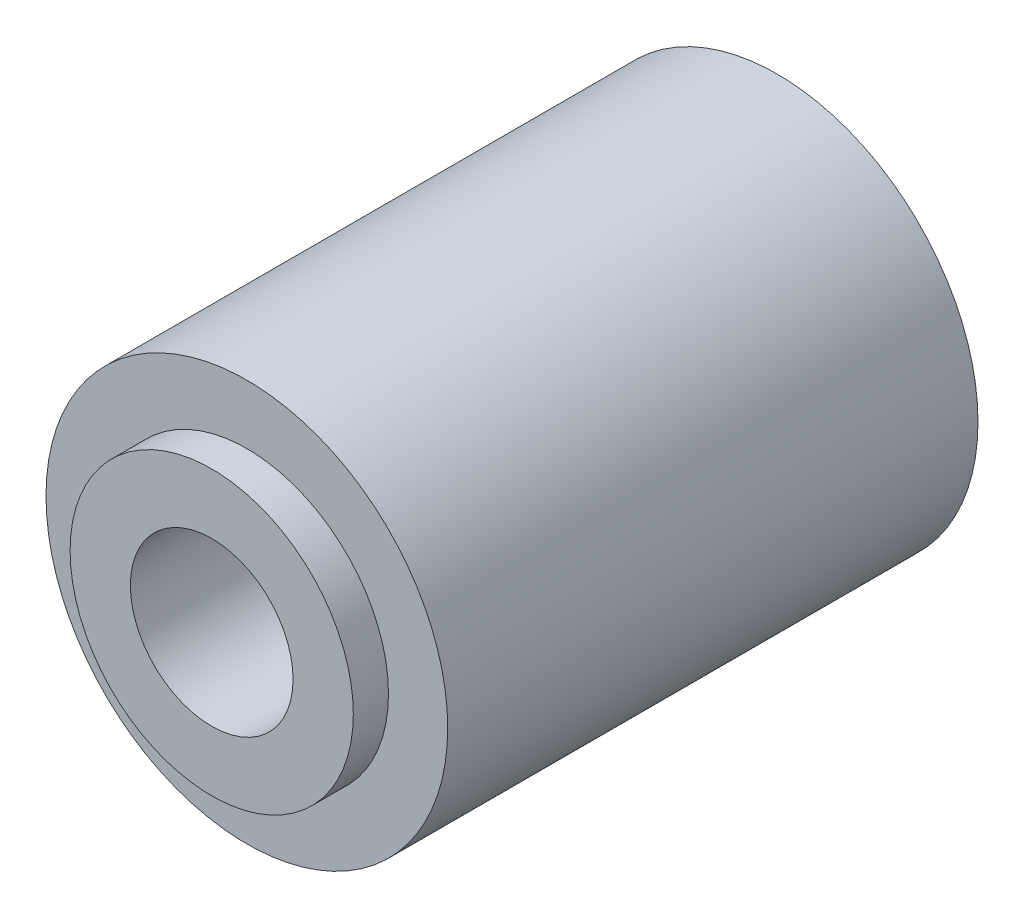
ISO-10303-21;
HEADER;
FILE_DESCRIPTION(('STEP AP214'),'2;1');
FILE_NAME('part.step','',(''),(''),'','','');
FILE_SCHEMA(('AUTOMOTIVE_DESIGN { 1 0 10303 214 1 1 1 1 }'));
ENDSEC;
DATA;
#1=APPLICATION_CONTEXT('core data for automotive mechanical design processes');
#2=APPLICATION_PROTOCOL_DEFINITION('international standard','automotive_design',2000,#1);
#3=PRODUCT_CONTEXT('',#1,'mechanical');
#4=PRODUCT('Part','Part','',(#3));
#5=PRODUCT_RELATED_PRODUCT_CATEGORY('part','',(#4));
#6=PRODUCT_DEFINITION_FORMATION('','',#4);
#7=PRODUCT_DEFINITION_CONTEXT('part definition',#1,'design');
#8=PRODUCT_DEFINITION('design','',#6,#7);
#9=PRODUCT_DEFINITION_SHAPE('','',#8);
#10=(LENGTH_UNIT() NAMED_UNIT(*) SI_UNIT(.MILLI.,.METRE.));
#11=(NAMED_UNIT(*) PLANE_ANGLE_UNIT() SI_UNIT($,.RADIAN.));
#12=(NAMED_UNIT(*) SI_UNIT($,.STERADIAN.) SOLID_ANGLE_UNIT());
#13=UNCERTAINTY_MEASURE_WITH_UNIT(LENGTH_MEASURE(1.E-05),#10,'distance_accuracy_value','');
#14=(GEOMETRIC_REPRESENTATION_CONTEXT(3) GLOBAL_UNCERTAINTY_ASSIGNED_CONTEXT((#13)) GLOBAL_UNIT_ASSIGNED_CONTEXT((#10,
#11,#12)) REPRESENTATION_CONTEXT('',''));
#15=CARTESIAN_POINT('',(0.,0.,0.));
#16=DIRECTION('',(0.,0.,1.));
#17=DIRECTION('',(1.,0.,0.));
#18=AXIS2_PLACEMENT_3D('',#15,#16,#17);
#19=CARTESIAN_POINT('',(0.,0.,0.));
#20=DIRECTION('',(0.,0.,1.));
#21=DIRECTION('',(1.,0.,0.));
#22=AXIS2_PLACEMENT_3D('',#19,#20,#21);
#23=PLANE('',#22);
#24=CARTESIAN_POINT('',(0.,0.,0.));
#25=DIRECTION('',(0.,0.,1.));
#26=DIRECTION('',(1.,0.,0.));
#27=AXIS2_PLACEMENT_3D('',#24,#25,#26);
#28=CIRCLE('',#27,10.);
#29=CARTESIAN_POINT('',(10.,0.,0.));
#30=VERTEX_POINT('',#29);
#31=EDGE_CURVE('E43',#30,#30,#28,.T.);
#32=ORIENTED_EDGE('',*,*,#31,.F.);
#33=EDGE_LOOP('',(#32));
#34=FACE_BOUND('',#33,.T.);
#35=CARTESIAN_POINT('',(0.,0.,0.));
#36=DIRECTION('',(0.,0.,1.));
#37=DIRECTION('',(1.,0.,0.));
#38=AXIS2_PLACEMENT_3D('',#35,#36,#37);
#39=CIRCLE('',#38,7.05);
#40=CARTESIAN_POINT('',(7.05,0.,0.));
#41=VERTEX_POINT('',#40);
#42=EDGE_CURVE('E10',#41,#41,#39,.F.);
#43=ORIENTED_EDGE('',*,*,#42,.F.);
#44=EDGE_LOOP('',(#43));
#45=FACE_BOUND('',#44,.T.);
#46=ADVANCED_FACE('F32',(#34,#45),#23,.F.);
#47=CARTESIAN_POINT('',(0.,0.,26.4));
#48=DIRECTION('',(0.,0.,1.));
#49=DIRECTION('',(1.,0.,0.));
#50=AXIS2_PLACEMENT_3D('',#47,#48,#49);
#51=PLANE('',#50);
#52=CARTESIAN_POINT('',(0.,0.,26.4));
#53=DIRECTION('',(0.,0.,1.));
#54=DIRECTION('',(1.,0.,0.));
#55=AXIS2_PLACEMENT_3D('',#52,#53,#54);
#56=CIRCLE('',#55,10.);
#57=CARTESIAN_POINT('',(10.,0.,26.4));
#58=VERTEX_POINT('',#57);
#59=EDGE_CURVE('E39',#58,#58,#56,.T.);
#60=ORIENTED_EDGE('',*,*,#59,.T.);
#61=EDGE_LOOP('',(#60));
#62=FACE_BOUND('',#61,.T.);
#63=CARTESIAN_POINT('',(0.,0.,26.4));
#64=DIRECTION('',(0.,0.,1.));
#65=DIRECTION('',(1.,0.,0.));
#66=AXIS2_PLACEMENT_3D('',#63,#64,#65);
#67=CIRCLE('',#66,7.05);
#68=CARTESIAN_POINT('',(7.05,0.,26.4));
#69=VERTEX_POINT('',#68);
#70=EDGE_CURVE('E50',#69,#69,#67,.T.);
#71=ORIENTED_EDGE('',*,*,#70,.F.);
#72=EDGE_LOOP('',(#71));
#73=FACE_BOUND('',#72,.T.);
#74=ADVANCED_FACE('F83',(#62,#73),#51,.T.);
#75=CARTESIAN_POINT('',(0.,0.,26.4));
#76=DIRECTION('',(0.,0.,-1.));
#77=DIRECTION('',(-1.,0.,0.));
#78=AXIS2_PLACEMENT_3D('',#75,#76,#77);
#79=CYLINDRICAL_SURFACE('',#78,10.);
#80=ORIENTED_EDGE('',*,*,#59,.F.);
#81=EDGE_LOOP('',(#80));
#82=FACE_BOUND('',#81,.T.);
#83=ORIENTED_EDGE('',*,*,#31,.T.);
#84=EDGE_LOOP('',(#83));
#85=FACE_BOUND('',#84,.T.);
#86=ADVANCED_FACE('F34',(#82,#85),#79,.T.);
#87=CARTESIAN_POINT('',(0.,0.,26.4));
#88=DIRECTION('',(0.,0.,-1.));
#89=DIRECTION('',(-1.,0.,0.));
#90=AXIS2_PLACEMENT_3D('',#87,#88,#89);
#91=CYLINDRICAL_SURFACE('',#90,4.05);
#92=CARTESIAN_POINT('',(0.,0.,28.15));
#93=DIRECTION('',(0.,0.,1.));
#94=DIRECTION('',(1.,0.,0.));
#95=AXIS2_PLACEMENT_3D('',#92,#93,#94);
#96=CIRCLE('',#95,4.05);
#97=CARTESIAN_POINT('',(4.05,0.,28.15));
#98=VERTEX_POINT('',#97);
#99=EDGE_CURVE('E53',#98,#98,#96,.T.);
#100=ORIENTED_EDGE('',*,*,#99,.T.);
#101=EDGE_LOOP('',(#100));
#102=FACE_BOUND('',#101,.T.);
#103=CARTESIAN_POINT('',(0.,0.,-1.75));
#104=DIRECTION('',(0.,0.,-1.));
#105=DIRECTION('',(-1.,0.,0.));
#106=AXIS2_PLACEMENT_3D('',#103,#104,#105);
#107=CIRCLE('',#106,4.05);
#108=CARTESIAN_POINT('',(-4.05,0.,-1.75));
#109=VERTEX_POINT('',#108);
#110=EDGE_CURVE('E61',#109,#109,#107,.T.);
#111=ORIENTED_EDGE('',*,*,#110,.T.);
#112=EDGE_LOOP('',(#111));
#113=FACE_BOUND('',#112,.T.);
#114=ADVANCED_FACE('F65',(#102,#113),#91,.F.);
#115=CARTESIAN_POINT('',(0.,0.,28.15));
#116=DIRECTION('',(0.,0.,1.));
#117=DIRECTION('',(1.,0.,0.));
#118=AXIS2_PLACEMENT_3D('',#115,#116,#117);
#119=PLANE('',#118);
#120=CARTESIAN_POINT('',(0.,0.,28.15));
#121=DIRECTION('',(0.,0.,1.));
#122=DIRECTION('',(1.,0.,0.));
#123=AXIS2_PLACEMENT_3D('',#120,#121,#122);
#124=CIRCLE('',#123,7.05);
#125=CARTESIAN_POINT('',(7.05,0.,28.15));
#126=VERTEX_POINT('',#125);
#127=EDGE_CURVE('E48',#126,#126,#124,.T.);
#128=ORIENTED_EDGE('',*,*,#127,.T.);
#129=EDGE_LOOP('',(#128));
#130=FACE_BOUND('',#129,.T.);
#131=ORIENTED_EDGE('',*,*,#99,.F.);
#132=EDGE_LOOP('',(#131));
#133=FACE_BOUND('',#132,.T.);
#134=ADVANCED_FACE('F79',(#130,#133),#119,.T.);
#135=CARTESIAN_POINT('',(0.,0.,28.15));
#136=DIRECTION('',(0.,0.,-1.));
#137=DIRECTION('',(-1.,0.,0.));
#138=AXIS2_PLACEMENT_3D('',#135,#136,#137);
#139=CYLINDRICAL_SURFACE('',#138,7.05);
#140=ORIENTED_EDGE('',*,*,#127,.F.);
#141=EDGE_LOOP('',(#140));
#142=FACE_BOUND('',#141,.T.);
#143=ORIENTED_EDGE('',*,*,#70,.T.);
#144=EDGE_LOOP('',(#143));
#145=FACE_BOUND('',#144,.T.);
#146=ADVANCED_FACE('F70',(#142,#145),#139,.T.);
#147=CARTESIAN_POINT('',(0.,0.,-1.75));
#148=DIRECTION('',(0.,0.,-1.));
#149=DIRECTION('',(-1.,0.,0.));
#150=AXIS2_PLACEMENT_3D('',#147,#148,#149);
#151=PLANE('',#150);
#152=CARTESIAN_POINT('',(0.,0.,-1.75));
#153=DIRECTION('',(0.,0.,-1.));
#154=DIRECTION('',(-1.,0.,0.));
#155=AXIS2_PLACEMENT_3D('',#152,#153,#154);
#156=CIRCLE('',#155,7.05);
#157=CARTESIAN_POINT('',(-7.05,0.,-1.75));
#158=VERTEX_POINT('',#157);
#159=EDGE_CURVE('E58',#158,#158,#156,.T.);
#160=ORIENTED_EDGE('',*,*,#159,.T.);
#161=EDGE_LOOP('',(#160));
#162=FACE_BOUND('',#161,.T.);
#163=ORIENTED_EDGE('',*,*,#110,.F.);
#164=EDGE_LOOP('',(#163));
#165=FACE_BOUND('',#164,.T.);
#166=ADVANCED_FACE('F67',(#162,#165),#151,.T.);
#167=CARTESIAN_POINT('',(0.,0.,-1.75));
#168=DIRECTION('',(0.,0.,1.));
#169=DIRECTION('',(1.,0.,0.));
#170=AXIS2_PLACEMENT_3D('',#167,#168,#169);
#171=CYLINDRICAL_SURFACE('',#170,7.05);
#172=ORIENTED_EDGE('',*,*,#159,.F.);
#173=EDGE_LOOP('',(#172));
#174=FACE_BOUND('',#173,.T.);
#175=ORIENTED_EDGE('',*,*,#42,.T.);
#176=EDGE_LOOP('',(#175));
#177=FACE_BOUND('',#176,.T.);
#178=ADVANCED_FACE('F69',(#174,#177),#171,.T.);
#179=CLOSED_SHELL('',(#46,#74,#86,#114,#134,#146,#166,#178));
#180=MANIFOLD_SOLID_BREP('B2',#179);
#181=ADVANCED_BREP_SHAPE_REPRESENTATION('',(#18,#180),#14);
#182=SHAPE_DEFINITION_REPRESENTATION(#9,#181);
ENDSEC;
END-ISO-10303-21;
